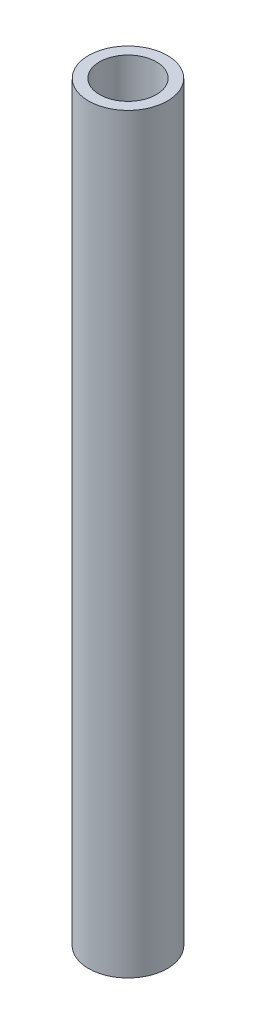
ISO-10303-21;
HEADER;
FILE_DESCRIPTION(('STEP AP214'),'2;1');
FILE_NAME('part.step','',(''),(''),'','','');
FILE_SCHEMA(('AUTOMOTIVE_DESIGN { 1 0 10303 214 1 1 1 1 }'));
ENDSEC;
DATA;
#1=APPLICATION_CONTEXT('core data for automotive mechanical design processes');
#2=APPLICATION_PROTOCOL_DEFINITION('international standard','automotive_design',2000,#1);
#3=PRODUCT_CONTEXT('',#1,'mechanical');
#4=PRODUCT('Part','Part','',(#3));
#5=PRODUCT_RELATED_PRODUCT_CATEGORY('part','',(#4));
#6=PRODUCT_DEFINITION_FORMATION('','',#4);
#7=PRODUCT_DEFINITION_CONTEXT('part definition',#1,'design');
#8=PRODUCT_DEFINITION('design','',#6,#7);
#9=PRODUCT_DEFINITION_SHAPE('','',#8);
#10=(LENGTH_UNIT() NAMED_UNIT(*) SI_UNIT(.MILLI.,.METRE.));
#11=(NAMED_UNIT(*) PLANE_ANGLE_UNIT() SI_UNIT($,.RADIAN.));
#12=(NAMED_UNIT(*) SI_UNIT($,.STERADIAN.) SOLID_ANGLE_UNIT());
#13=UNCERTAINTY_MEASURE_WITH_UNIT(LENGTH_MEASURE(1.E-05),#10,'distance_accuracy_value','');
#14=(GEOMETRIC_REPRESENTATION_CONTEXT(3) GLOBAL_UNCERTAINTY_ASSIGNED_CONTEXT((#13)) GLOBAL_UNIT_ASSIGNED_CONTEXT((#10,
#11,#12)) REPRESENTATION_CONTEXT('',''));
#15=CARTESIAN_POINT('',(0.,0.,0.));
#16=DIRECTION('',(0.,0.,1.));
#17=DIRECTION('',(1.,0.,0.));
#18=AXIS2_PLACEMENT_3D('',#15,#16,#17);
#19=CARTESIAN_POINT('',(0.,60.480702,0.));
#20=DIRECTION('',(0.,1.,0.));
#21=DIRECTION('',(0.,0.,1.));
#22=AXIS2_PLACEMENT_3D('',#19,#20,#21);
#23=PLANE('',#22);
#24=CARTESIAN_POINT('',(0.,60.480702,0.));
#25=DIRECTION('',(0.,1.,0.));
#26=DIRECTION('',(0.,0.,1.));
#27=AXIS2_PLACEMENT_3D('',#24,#25,#26);
#28=CIRCLE('',#27,3.175);
#29=CARTESIAN_POINT('',(0.,60.480702,3.175));
#30=VERTEX_POINT('',#29);
#31=EDGE_CURVE('E10',#30,#30,#28,.T.);
#32=ORIENTED_EDGE('',*,*,#31,.T.);
#33=EDGE_LOOP('',(#32));
#34=FACE_BOUND('',#33,.T.);
#35=CARTESIAN_POINT('',(0.,60.480702,0.));
#36=DIRECTION('',(0.,1.,0.));
#37=DIRECTION('',(0.,0.,1.));
#38=AXIS2_PLACEMENT_3D('',#35,#36,#37);
#39=CIRCLE('',#38,2.286);
#40=CARTESIAN_POINT('',(0.,60.480702,2.286));
#41=VERTEX_POINT('',#40);
#42=EDGE_CURVE('E41',#41,#41,#39,.T.);
#43=ORIENTED_EDGE('',*,*,#42,.F.);
#44=EDGE_LOOP('',(#43));
#45=FACE_BOUND('',#44,.T.);
#46=ADVANCED_FACE('F30',(#34,#45),#23,.T.);
#47=CARTESIAN_POINT('',(0.,0.,0.));
#48=DIRECTION('',(0.,1.,0.));
#49=DIRECTION('',(0.,0.,1.));
#50=AXIS2_PLACEMENT_3D('',#47,#48,#49);
#51=PLANE('',#50);
#52=CARTESIAN_POINT('',(0.,0.,0.));
#53=DIRECTION('',(0.,1.,0.));
#54=DIRECTION('',(0.,0.,1.));
#55=AXIS2_PLACEMENT_3D('',#52,#53,#54);
#56=CIRCLE('',#55,3.175);
#57=CARTESIAN_POINT('',(0.,0.,3.175));
#58=VERTEX_POINT('',#57);
#59=EDGE_CURVE('E34',#58,#58,#56,.T.);
#60=ORIENTED_EDGE('',*,*,#59,.F.);
#61=EDGE_LOOP('',(#60));
#62=FACE_BOUND('',#61,.T.);
#63=CARTESIAN_POINT('',(0.,0.,0.));
#64=DIRECTION('',(0.,1.,0.));
#65=DIRECTION('',(0.,0.,1.));
#66=AXIS2_PLACEMENT_3D('',#63,#64,#65);
#67=CIRCLE('',#66,2.286);
#68=CARTESIAN_POINT('',(0.,0.,2.286));
#69=VERTEX_POINT('',#68);
#70=EDGE_CURVE('E43',#69,#69,#67,.T.);
#71=ORIENTED_EDGE('',*,*,#70,.T.);
#72=EDGE_LOOP('',(#71));
#73=FACE_BOUND('',#72,.T.);
#74=ADVANCED_FACE('F53',(#62,#73),#51,.F.);
#75=CARTESIAN_POINT('',(0.,60.480702,0.));
#76=DIRECTION('',(0.,-1.,0.));
#77=DIRECTION('',(0.,0.,-1.));
#78=AXIS2_PLACEMENT_3D('',#75,#76,#77);
#79=CYLINDRICAL_SURFACE('',#78,3.175);
#80=ORIENTED_EDGE('',*,*,#31,.F.);
#81=EDGE_LOOP('',(#80));
#82=FACE_BOUND('',#81,.T.);
#83=ORIENTED_EDGE('',*,*,#59,.T.);
#84=EDGE_LOOP('',(#83));
#85=FACE_BOUND('',#84,.T.);
#86=ADVANCED_FACE('F32',(#82,#85),#79,.T.);
#87=CARTESIAN_POINT('',(0.,60.480702,0.));
#88=DIRECTION('',(0.,-1.,0.));
#89=DIRECTION('',(0.,0.,-1.));
#90=AXIS2_PLACEMENT_3D('',#87,#88,#89);
#91=CYLINDRICAL_SURFACE('',#90,2.286);
#92=ORIENTED_EDGE('',*,*,#42,.T.);
#93=EDGE_LOOP('',(#92));
#94=FACE_BOUND('',#93,.T.);
#95=ORIENTED_EDGE('',*,*,#70,.F.);
#96=EDGE_LOOP('',(#95));
#97=FACE_BOUND('',#96,.T.);
#98=ADVANCED_FACE('F49',(#94,#97),#91,.F.);
#99=CLOSED_SHELL('',(#46,#74,#86,#98));
#100=MANIFOLD_SOLID_BREP('B2',#99);
#101=ADVANCED_BREP_SHAPE_REPRESENTATION('',(#18,#100),#14);
#102=SHAPE_DEFINITION_REPRESENTATION(#9,#101);
ENDSEC;
END-ISO-10303-21;
